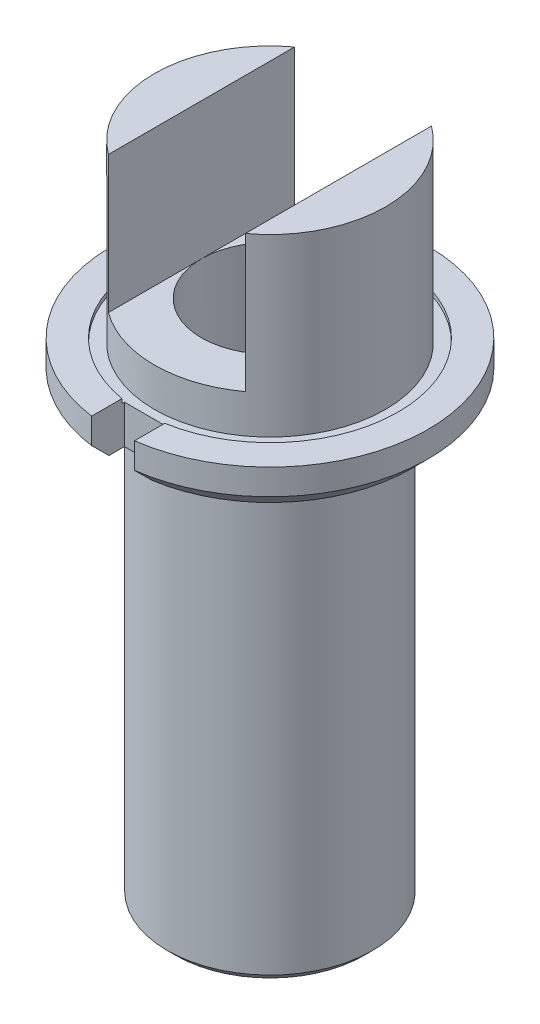
ISO-10303-21;
HEADER;
FILE_DESCRIPTION(('STEP AP214'),'2;1');
FILE_NAME('part.step','',(''),(''),'','','');
FILE_SCHEMA(('AUTOMOTIVE_DESIGN { 1 0 10303 214 1 1 1 1 }'));
ENDSEC;
DATA;
#1=APPLICATION_CONTEXT('core data for automotive mechanical design processes');
#2=APPLICATION_PROTOCOL_DEFINITION('international standard','automotive_design',2000,#1);
#3=PRODUCT_CONTEXT('',#1,'mechanical');
#4=PRODUCT('Part','Part','',(#3));
#5=PRODUCT_RELATED_PRODUCT_CATEGORY('part','',(#4));
#6=PRODUCT_DEFINITION_FORMATION('','',#4);
#7=PRODUCT_DEFINITION_CONTEXT('part definition',#1,'design');
#8=PRODUCT_DEFINITION('design','',#6,#7);
#9=PRODUCT_DEFINITION_SHAPE('','',#8);
#10=(LENGTH_UNIT() NAMED_UNIT(*) SI_UNIT(.MILLI.,.METRE.));
#11=(NAMED_UNIT(*) PLANE_ANGLE_UNIT() SI_UNIT($,.RADIAN.));
#12=(NAMED_UNIT(*) SI_UNIT($,.STERADIAN.) SOLID_ANGLE_UNIT());
#13=UNCERTAINTY_MEASURE_WITH_UNIT(LENGTH_MEASURE(1.E-05),#10,'distance_accuracy_value','');
#14=(GEOMETRIC_REPRESENTATION_CONTEXT(3) GLOBAL_UNCERTAINTY_ASSIGNED_CONTEXT((#13)) GLOBAL_UNIT_ASSIGNED_CONTEXT((#10,
#11,#12)) REPRESENTATION_CONTEXT('',''));
#15=CARTESIAN_POINT('',(0.,0.,0.));
#16=DIRECTION('',(0.,0.,1.));
#17=DIRECTION('',(1.,0.,0.));
#18=AXIS2_PLACEMENT_3D('',#15,#16,#17);
#19=CARTESIAN_POINT('',(0.,38.5,0.));
#20=DIRECTION('',(0.,1.,0.));
#21=DIRECTION('',(0.,0.,1.));
#22=AXIS2_PLACEMENT_3D('',#19,#20,#21);
#23=CYLINDRICAL_SURFACE('',#22,18.5);
#24=CARTESIAN_POINT('',(0.,18.5,0.));
#25=DIRECTION('',(0.,1.,0.));
#26=DIRECTION('',(0.,0.,1.));
#27=AXIS2_PLACEMENT_3D('',#24,#25,#26);
#28=CIRCLE('',#27,18.5);
#29=CARTESIAN_POINT('',(2.5,18.5,18.3303027798233));
#30=VERTEX_POINT('',#29);
#31=CARTESIAN_POINT('',(-2.5,18.5,18.3303027798233));
#32=VERTEX_POINT('',#31);
#33=EDGE_CURVE('E139',#30,#32,#28,.T.);
#34=ORIENTED_EDGE('',*,*,#33,.F.);
#35=DIRECTION('',(0.,1.,0.));
#36=VECTOR('',#35,1.);
#37=CARTESIAN_POINT('',(2.5,38.5,18.3303027798234));
#38=LINE('',#37,#36);
#39=CARTESIAN_POINT('',(2.5,15.5,18.3303027798234));
#40=VERTEX_POINT('',#39);
#41=EDGE_CURVE('E130',#30,#40,#38,.F.);
#42=ORIENTED_EDGE('',*,*,#41,.T.);
#43=CARTESIAN_POINT('',(0.,15.5,0.));
#44=DIRECTION('',(0.,1.,0.));
#45=DIRECTION('',(0.,0.,1.));
#46=AXIS2_PLACEMENT_3D('',#43,#44,#45);
#47=CIRCLE('',#46,18.5);
#48=CARTESIAN_POINT('',(-2.5,15.5,18.3303027798233));
#49=VERTEX_POINT('',#48);
#50=EDGE_CURVE('E204',#40,#49,#47,.T.);
#51=ORIENTED_EDGE('',*,*,#50,.T.);
#52=DIRECTION('',(0.,1.,0.));
#53=VECTOR('',#52,1.);
#54=CARTESIAN_POINT('',(-2.5,38.5,18.3303027798233));
#55=LINE('',#54,#53);
#56=EDGE_CURVE('E46',#49,#32,#55,.T.);
#57=ORIENTED_EDGE('',*,*,#56,.T.);
#58=EDGE_LOOP('',(#34,#42,#51,#57));
#59=FACE_BOUND('',#58,.T.);
#60=ADVANCED_FACE('F31',(#59),#23,.T.);
#61=CARTESIAN_POINT('',(13.5,38.5,0.));
#62=DIRECTION('',(0.,-1.,0.));
#63=DIRECTION('',(0.,0.,-1.));
#64=AXIS2_PLACEMENT_3D('',#61,#62,#63);
#65=PLANE('',#64);
#66=CARTESIAN_POINT('',(0.,38.5,0.));
#67=DIRECTION('',(0.,1.,0.));
#68=DIRECTION('',(0.,0.,1.));
#69=AXIS2_PLACEMENT_3D('',#66,#67,#68);
#70=CIRCLE('',#69,13.5);
#71=CARTESIAN_POINT('',(7.99999999999999,38.5,10.8742815854658));
#72=VERTEX_POINT('',#71);
#73=CARTESIAN_POINT('',(7.99999999999999,38.5,-10.8742815854658));
#74=VERTEX_POINT('',#73);
#75=EDGE_CURVE('E187',#72,#74,#70,.T.);
#76=ORIENTED_EDGE('',*,*,#75,.T.);
#77=DIRECTION('',(0.,0.,1.));
#78=VECTOR('',#77,1.);
#79=CARTESIAN_POINT('',(7.99999999999999,38.5,-25.));
#80=LINE('',#79,#78);
#81=EDGE_CURVE('E149',#74,#72,#80,.T.);
#82=ORIENTED_EDGE('',*,*,#81,.T.);
#83=EDGE_LOOP('',(#76,#82));
#84=FACE_BOUND('',#83,.T.);
#85=ADVANCED_FACE('F271',(#84),#65,.F.);
#86=CARTESIAN_POINT('',(0.,38.5,0.));
#87=DIRECTION('',(0.,1.,0.));
#88=DIRECTION('',(0.,0.,1.));
#89=AXIS2_PLACEMENT_3D('',#86,#87,#88);
#90=CYLINDRICAL_SURFACE('',#89,8.);
#91=CARTESIAN_POINT('',(0.,-38.5,0.));
#92=DIRECTION('',(0.,1.,0.));
#93=DIRECTION('',(0.,0.,1.));
#94=AXIS2_PLACEMENT_3D('',#91,#92,#93);
#95=CIRCLE('',#94,8.);
#96=CARTESIAN_POINT('',(0.,-38.5,8.));
#97=VERTEX_POINT('',#96);
#98=EDGE_CURVE('E191',#97,#97,#95,.T.);
#99=ORIENTED_EDGE('',*,*,#98,.F.);
#100=EDGE_LOOP('',(#99));
#101=FACE_BOUND('',#100,.T.);
#102=CARTESIAN_POINT('',(0.,-13.5,0.));
#103=DIRECTION('',(0.,1.,0.));
#104=DIRECTION('',(0.,0.,1.));
#105=AXIS2_PLACEMENT_3D('',#102,#103,#104);
#106=CIRCLE('',#105,7.99999999999999);
#107=CARTESIAN_POINT('',(0.,-13.5,7.99999999999999));
#108=VERTEX_POINT('',#107);
#109=EDGE_CURVE('E180',#108,#108,#106,.T.);
#110=ORIENTED_EDGE('',*,*,#109,.T.);
#111=EDGE_LOOP('',(#110));
#112=FACE_BOUND('',#111,.T.);
#113=ADVANCED_FACE('F291',(#101,#112),#90,.F.);
#114=CARTESIAN_POINT('',(8.00000000000001,-38.5,0.));
#115=DIRECTION('',(0.,1.,0.));
#116=DIRECTION('',(0.,0.,1.));
#117=AXIS2_PLACEMENT_3D('',#114,#115,#116);
#118=PLANE('',#117);
#119=CARTESIAN_POINT('',(0.,-38.5,0.));
#120=DIRECTION('',(0.,1.,0.));
#121=DIRECTION('',(0.,0.,1.));
#122=AXIS2_PLACEMENT_3D('',#119,#120,#121);
#123=CIRCLE('',#122,11.);
#124=CARTESIAN_POINT('',(0.,-38.5,11.));
#125=VERTEX_POINT('',#124);
#126=EDGE_CURVE('E11',#125,#125,#123,.F.);
#127=ORIENTED_EDGE('',*,*,#126,.T.);
#128=EDGE_LOOP('',(#127));
#129=FACE_BOUND('',#128,.T.);
#130=ORIENTED_EDGE('',*,*,#98,.T.);
#131=EDGE_LOOP('',(#130));
#132=FACE_BOUND('',#131,.T.);
#133=ADVANCED_FACE('F287',(#129,#132),#118,.F.);
#134=CARTESIAN_POINT('',(0.,38.5,0.));
#135=DIRECTION('',(0.,1.,0.));
#136=DIRECTION('',(0.,0.,1.));
#137=AXIS2_PLACEMENT_3D('',#134,#135,#136);
#138=CYLINDRICAL_SURFACE('',#137,12.);
#139=CARTESIAN_POINT('',(0.,-37.5,0.));
#140=DIRECTION('',(0.,1.,0.));
#141=DIRECTION('',(0.,0.,1.));
#142=AXIS2_PLACEMENT_3D('',#139,#140,#141);
#143=CIRCLE('',#142,12.);
#144=CARTESIAN_POINT('',(0.,-37.5,12.));
#145=VERTEX_POINT('',#144);
#146=EDGE_CURVE('E39',#145,#145,#143,.T.);
#147=ORIENTED_EDGE('',*,*,#146,.T.);
#148=EDGE_LOOP('',(#147));
#149=FACE_BOUND('',#148,.T.);
#150=CARTESIAN_POINT('',(0.,11.5,0.));
#151=DIRECTION('',(0.,1.,0.));
#152=DIRECTION('',(0.,0.,1.));
#153=AXIS2_PLACEMENT_3D('',#150,#151,#152);
#154=CIRCLE('',#153,12.);
#155=CARTESIAN_POINT('',(0.,11.5,12.));
#156=VERTEX_POINT('',#155);
#157=EDGE_CURVE('E201',#156,#156,#154,.F.);
#158=ORIENTED_EDGE('',*,*,#157,.T.);
#159=EDGE_LOOP('',(#158));
#160=FACE_BOUND('',#159,.T.);
#161=ADVANCED_FACE('F283',(#149,#160),#138,.T.);
#162=CARTESIAN_POINT('',(12.,13.5,0.));
#163=DIRECTION('',(0.,1.,0.));
#164=DIRECTION('',(0.,0.,1.));
#165=AXIS2_PLACEMENT_3D('',#162,#163,#164);
#166=PLANE('',#165);
#167=CARTESIAN_POINT('',(0.,13.5,0.));
#168=DIRECTION('',(0.,1.,0.));
#169=DIRECTION('',(0.,0.,1.));
#170=AXIS2_PLACEMENT_3D('',#167,#168,#169);
#171=CIRCLE('',#170,16.5);
#172=CARTESIAN_POINT('',(-2.5,13.5,16.3095064303001));
#173=VERTEX_POINT('',#172);
#174=CARTESIAN_POINT('',(2.5,13.5,16.3095064303001));
#175=VERTEX_POINT('',#174);
#176=EDGE_CURVE('E207',#173,#175,#171,.F.);
#177=ORIENTED_EDGE('',*,*,#176,.T.);
#178=DIRECTION('',(0.,0.,-1.));
#179=VECTOR('',#178,1.);
#180=CARTESIAN_POINT('',(2.5,13.5,0.));
#181=LINE('',#180,#179);
#182=CARTESIAN_POINT('',(2.5,13.5,14.5));
#183=VERTEX_POINT('',#182);
#184=EDGE_CURVE('E316',#175,#183,#181,.T.);
#185=ORIENTED_EDGE('',*,*,#184,.T.);
#186=DIRECTION('',(-1.,0.,0.));
#187=VECTOR('',#186,1.);
#188=CARTESIAN_POINT('',(12.,13.5,14.5));
#189=LINE('',#188,#187);
#190=CARTESIAN_POINT('',(-2.5,13.5,14.5));
#191=VERTEX_POINT('',#190);
#192=EDGE_CURVE('E152',#183,#191,#189,.T.);
#193=ORIENTED_EDGE('',*,*,#192,.T.);
#194=DIRECTION('',(0.,0.,1.));
#195=VECTOR('',#194,1.);
#196=CARTESIAN_POINT('',(-2.5,13.5,0.));
#197=LINE('',#196,#195);
#198=EDGE_CURVE('E317',#191,#173,#197,.T.);
#199=ORIENTED_EDGE('',*,*,#198,.T.);
#200=EDGE_LOOP('',(#177,#185,#193,#199));
#201=FACE_BOUND('',#200,.T.);
#202=CARTESIAN_POINT('',(0.,13.5,0.));
#203=DIRECTION('',(0.,1.,0.));
#204=DIRECTION('',(0.,0.,1.));
#205=AXIS2_PLACEMENT_3D('',#202,#203,#204);
#206=CIRCLE('',#205,14.);
#207=CARTESIAN_POINT('',(0.,13.5,14.));
#208=VERTEX_POINT('',#207);
#209=EDGE_CURVE('E198',#208,#208,#206,.T.);
#210=ORIENTED_EDGE('',*,*,#209,.T.);
#211=EDGE_LOOP('',(#210));
#212=FACE_BOUND('',#211,.T.);
#213=ADVANCED_FACE('F277',(#201,#212),#166,.F.);
#214=CARTESIAN_POINT('',(18.5,18.5,0.));
#215=DIRECTION('',(0.,-1.,0.));
#216=DIRECTION('',(0.,0.,-1.));
#217=AXIS2_PLACEMENT_3D('',#214,#215,#216);
#218=PLANE('',#217);
#219=CARTESIAN_POINT('',(0.,18.5,0.));
#220=DIRECTION('',(0.,1.,0.));
#221=DIRECTION('',(0.,0.,1.));
#222=AXIS2_PLACEMENT_3D('',#219,#220,#221);
#223=CIRCLE('',#222,15.);
#224=CARTESIAN_POINT('',(2.5,18.5,14.790199457749));
#225=VERTEX_POINT('',#224);
#226=CARTESIAN_POINT('',(-2.5,18.5,14.790199457749));
#227=VERTEX_POINT('',#226);
#228=EDGE_CURVE('E137',#225,#227,#223,.T.);
#229=ORIENTED_EDGE('',*,*,#228,.F.);
#230=DIRECTION('',(0.,0.,-1.));
#231=VECTOR('',#230,1.);
#232=CARTESIAN_POINT('',(2.5,18.5,14.5));
#233=LINE('',#232,#231);
#234=EDGE_CURVE('E141',#30,#225,#233,.T.);
#235=ORIENTED_EDGE('',*,*,#234,.F.);
#236=ORIENTED_EDGE('',*,*,#33,.T.);
#237=DIRECTION('',(0.,0.,1.));
#238=VECTOR('',#237,1.);
#239=CARTESIAN_POINT('',(-2.5,18.5,14.5));
#240=LINE('',#239,#238);
#241=EDGE_CURVE('E122',#227,#32,#240,.T.);
#242=ORIENTED_EDGE('',*,*,#241,.F.);
#243=EDGE_LOOP('',(#229,#235,#236,#242));
#244=FACE_BOUND('',#243,.T.);
#245=ADVANCED_FACE('F135',(#244),#218,.F.);
#246=CARTESIAN_POINT('',(0.,38.5,0.));
#247=DIRECTION('',(0.,1.,0.));
#248=DIRECTION('',(0.,0.,1.));
#249=AXIS2_PLACEMENT_3D('',#246,#247,#248);
#250=CYLINDRICAL_SURFACE('',#249,13.5);
#251=ORIENTED_EDGE('',*,*,#75,.F.);
#252=DIRECTION('',(0.,1.,0.));
#253=VECTOR('',#252,1.);
#254=CARTESIAN_POINT('',(7.99999999999999,38.5,10.8742815854658));
#255=LINE('',#254,#253);
#256=CARTESIAN_POINT('',(8.,22.5,10.8742815854658));
#257=VERTEX_POINT('',#256);
#258=EDGE_CURVE('E174',#72,#257,#255,.F.);
#259=ORIENTED_EDGE('',*,*,#258,.T.);
#260=CARTESIAN_POINT('',(0.,22.5,0.));
#261=DIRECTION('',(0.,-1.,0.));
#262=DIRECTION('',(0.,0.,-1.));
#263=AXIS2_PLACEMENT_3D('',#260,#261,#262);
#264=CIRCLE('',#263,13.5);
#265=CARTESIAN_POINT('',(-8.,22.5,10.8742815854658));
#266=VERTEX_POINT('',#265);
#267=EDGE_CURVE('E173',#257,#266,#264,.T.);
#268=ORIENTED_EDGE('',*,*,#267,.T.);
#269=DIRECTION('',(0.,1.,0.));
#270=VECTOR('',#269,1.);
#271=CARTESIAN_POINT('',(-8.00000000000001,38.5,10.8742815854658));
#272=LINE('',#271,#270);
#273=CARTESIAN_POINT('',(-8.00000000000001,38.5,10.8742815854658));
#274=VERTEX_POINT('',#273);
#275=EDGE_CURVE('E167',#266,#274,#272,.T.);
#276=ORIENTED_EDGE('',*,*,#275,.T.);
#277=CARTESIAN_POINT('',(-8.00000000000001,38.5,-10.8742815854658));
#278=VERTEX_POINT('',#277);
#279=EDGE_CURVE('E186',#278,#274,#70,.T.);
#280=ORIENTED_EDGE('',*,*,#279,.F.);
#281=DIRECTION('',(0.,1.,0.));
#282=VECTOR('',#281,1.);
#283=CARTESIAN_POINT('',(-8.00000000000001,38.5,-10.8742815854658));
#284=LINE('',#283,#282);
#285=CARTESIAN_POINT('',(-8.,22.5,-10.8742815854658));
#286=VERTEX_POINT('',#285);
#287=EDGE_CURVE('E54',#278,#286,#284,.F.);
#288=ORIENTED_EDGE('',*,*,#287,.T.);
#289=CARTESIAN_POINT('',(8.,22.5,-10.8742815854658));
#290=VERTEX_POINT('',#289);
#291=EDGE_CURVE('E170',#286,#290,#264,.T.);
#292=ORIENTED_EDGE('',*,*,#291,.T.);
#293=DIRECTION('',(0.,1.,0.));
#294=VECTOR('',#293,1.);
#295=CARTESIAN_POINT('',(7.99999999999999,38.5,-10.8742815854658));
#296=LINE('',#295,#294);
#297=EDGE_CURVE('E177',#290,#74,#296,.T.);
#298=ORIENTED_EDGE('',*,*,#297,.T.);
#299=EDGE_LOOP('',(#251,#259,#268,#276,#280,#288,#292,#298));
#300=FACE_BOUND('',#299,.T.);
#301=CARTESIAN_POINT('',(0.,18.,0.));
#302=DIRECTION('',(0.,1.,0.));
#303=DIRECTION('',(0.,0.,1.));
#304=AXIS2_PLACEMENT_3D('',#301,#302,#303);
#305=CIRCLE('',#304,13.5);
#306=CARTESIAN_POINT('',(0.,18.,13.5));
#307=VERTEX_POINT('',#306);
#308=EDGE_CURVE('E147',#307,#307,#305,.T.);
#309=ORIENTED_EDGE('',*,*,#308,.T.);
#310=EDGE_LOOP('',(#309));
#311=FACE_BOUND('',#310,.T.);
#312=ADVANCED_FACE('F269',(#300,#311),#250,.T.);
#313=ORIENTED_EDGE('',*,*,#279,.T.);
#314=DIRECTION('',(0.,0.,1.));
#315=VECTOR('',#314,1.);
#316=CARTESIAN_POINT('',(-8.00000000000001,38.5,-25.));
#317=LINE('',#316,#315);
#318=EDGE_CURVE('E163',#278,#274,#317,.T.);
#319=ORIENTED_EDGE('',*,*,#318,.F.);
#320=EDGE_LOOP('',(#313,#319));
#321=FACE_BOUND('',#320,.T.);
#322=ADVANCED_FACE('F265',(#321),#65,.F.);
#323=CARTESIAN_POINT('',(0.,38.5,0.));
#324=DIRECTION('',(0.,1.,0.));
#325=DIRECTION('',(0.,0.,1.));
#326=AXIS2_PLACEMENT_3D('',#323,#324,#325);
#327=CYLINDRICAL_SURFACE('',#326,8.);
#328=CARTESIAN_POINT('',(0.,2.5,0.));
#329=DIRECTION('',(0.,1.,0.));
#330=DIRECTION('',(0.,0.,1.));
#331=AXIS2_PLACEMENT_3D('',#328,#329,#330);
#332=CIRCLE('',#331,8.);
#333=CARTESIAN_POINT('',(0.,2.5,8.));
#334=VERTEX_POINT('',#333);
#335=EDGE_CURVE('E183',#334,#334,#332,.T.);
#336=ORIENTED_EDGE('',*,*,#335,.F.);
#337=EDGE_LOOP('',(#336));
#338=FACE_BOUND('',#337,.T.);
#339=CARTESIAN_POINT('',(0.,22.5,0.));
#340=DIRECTION('',(0.,-1.,0.));
#341=DIRECTION('',(0.,0.,-1.));
#342=AXIS2_PLACEMENT_3D('',#339,#340,#341);
#343=CIRCLE('',#342,8.);
#344=CARTESIAN_POINT('',(8.,22.5,0.));
#345=VERTEX_POINT('',#344);
#346=CARTESIAN_POINT('',(-8.,22.5,0.));
#347=VERTEX_POINT('',#346);
#348=EDGE_CURVE('E194',#345,#347,#343,.F.);
#349=ORIENTED_EDGE('',*,*,#348,.T.);
#350=EDGE_CURVE('E197',#347,#345,#343,.F.);
#351=ORIENTED_EDGE('',*,*,#350,.T.);
#352=EDGE_LOOP('',(#349,#351));
#353=FACE_BOUND('',#352,.T.);
#354=ADVANCED_FACE('F261',(#338,#353),#327,.F.);
#355=CARTESIAN_POINT('',(0.,38.5,0.));
#356=DIRECTION('',(0.,1.,0.));
#357=DIRECTION('',(0.,0.,1.));
#358=AXIS2_PLACEMENT_3D('',#355,#356,#357);
#359=CYLINDRICAL_SURFACE('',#358,8.49999999999999);
#360=CARTESIAN_POINT('',(0.,2.,0.));
#361=DIRECTION('',(0.,1.,0.));
#362=DIRECTION('',(0.,0.,1.));
#363=AXIS2_PLACEMENT_3D('',#360,#361,#362);
#364=CIRCLE('',#363,8.49999999999999);
#365=CARTESIAN_POINT('',(0.,2.,8.49999999999999));
#366=VERTEX_POINT('',#365);
#367=EDGE_CURVE('E337',#366,#366,#364,.T.);
#368=ORIENTED_EDGE('',*,*,#367,.T.);
#369=EDGE_LOOP('',(#368));
#370=FACE_BOUND('',#369,.T.);
#371=CARTESIAN_POINT('',(0.,-13.,0.));
#372=DIRECTION('',(0.,-1.,0.));
#373=DIRECTION('',(0.,0.,-1.));
#374=AXIS2_PLACEMENT_3D('',#371,#372,#373);
#375=CIRCLE('',#374,8.49999999999999);
#376=CARTESIAN_POINT('',(0.,-13.,-8.49999999999999));
#377=VERTEX_POINT('',#376);
#378=EDGE_CURVE('E335',#377,#377,#375,.T.);
#379=ORIENTED_EDGE('',*,*,#378,.T.);
#380=EDGE_LOOP('',(#379));
#381=FACE_BOUND('',#380,.T.);
#382=ADVANCED_FACE('F257',(#370,#381),#359,.F.);
#383=CARTESIAN_POINT('',(7.99999999999999,38.5,-25.));
#384=DIRECTION('',(1.,0.,0.));
#385=DIRECTION('',(0.,1.,0.));
#386=AXIS2_PLACEMENT_3D('',#383,#384,#385);
#387=PLANE('',#386);
#388=DIRECTION('',(0.,0.,1.));
#389=VECTOR('',#388,1.);
#390=CARTESIAN_POINT('',(8.,22.5,-25.));
#391=LINE('',#390,#389);
#392=EDGE_CURVE('E158',#290,#345,#391,.T.);
#393=ORIENTED_EDGE('',*,*,#392,.T.);
#394=EDGE_CURVE('E155',#345,#257,#391,.T.);
#395=ORIENTED_EDGE('',*,*,#394,.T.);
#396=ORIENTED_EDGE('',*,*,#258,.F.);
#397=ORIENTED_EDGE('',*,*,#81,.F.);
#398=ORIENTED_EDGE('',*,*,#297,.F.);
#399=EDGE_LOOP('',(#393,#395,#396,#397,#398));
#400=FACE_BOUND('',#399,.T.);
#401=ADVANCED_FACE('F251',(#400),#387,.F.);
#402=CARTESIAN_POINT('',(-8.,22.5,-25.));
#403=DIRECTION('',(0.,-1.,0.));
#404=DIRECTION('',(0.,0.,-1.));
#405=AXIS2_PLACEMENT_3D('',#402,#403,#404);
#406=PLANE('',#405);
#407=ORIENTED_EDGE('',*,*,#394,.F.);
#408=ORIENTED_EDGE('',*,*,#350,.F.);
#409=DIRECTION('',(0.,0.,1.));
#410=VECTOR('',#409,1.);
#411=CARTESIAN_POINT('',(-8.,22.5,-25.));
#412=LINE('',#411,#410);
#413=EDGE_CURVE('E160',#347,#266,#412,.T.);
#414=ORIENTED_EDGE('',*,*,#413,.T.);
#415=ORIENTED_EDGE('',*,*,#267,.F.);
#416=EDGE_LOOP('',(#407,#408,#414,#415));
#417=FACE_BOUND('',#416,.T.);
#418=ADVANCED_FACE('F247',(#417),#406,.F.);
#419=EDGE_CURVE('E159',#286,#347,#412,.T.);
#420=ORIENTED_EDGE('',*,*,#419,.T.);
#421=ORIENTED_EDGE('',*,*,#348,.F.);
#422=ORIENTED_EDGE('',*,*,#392,.F.);
#423=ORIENTED_EDGE('',*,*,#291,.F.);
#424=EDGE_LOOP('',(#420,#421,#422,#423));
#425=FACE_BOUND('',#424,.T.);
#426=ADVANCED_FACE('F250',(#425),#406,.F.);
#427=CARTESIAN_POINT('',(-8.00000000000001,38.5,-25.));
#428=DIRECTION('',(-1.,0.,0.));
#429=DIRECTION('',(0.,-1.,0.));
#430=AXIS2_PLACEMENT_3D('',#427,#428,#429);
#431=PLANE('',#430);
#432=ORIENTED_EDGE('',*,*,#413,.F.);
#433=ORIENTED_EDGE('',*,*,#419,.F.);
#434=ORIENTED_EDGE('',*,*,#287,.F.);
#435=ORIENTED_EDGE('',*,*,#318,.T.);
#436=ORIENTED_EDGE('',*,*,#275,.F.);
#437=EDGE_LOOP('',(#432,#433,#434,#435,#436));
#438=FACE_BOUND('',#437,.T.);
#439=ADVANCED_FACE('F246',(#438),#431,.F.);
#440=CARTESIAN_POINT('',(0.,18.,0.));
#441=DIRECTION('',(0.,1.,0.));
#442=DIRECTION('',(0.,0.,1.));
#443=AXIS2_PLACEMENT_3D('',#440,#441,#442);
#444=CYLINDRICAL_SURFACE('',#443,15.);
#445=CARTESIAN_POINT('',(0.,18.,0.));
#446=DIRECTION('',(0.,1.,0.));
#447=DIRECTION('',(0.,0.,1.));
#448=AXIS2_PLACEMENT_3D('',#445,#446,#447);
#449=CIRCLE('',#448,15.);
#450=CARTESIAN_POINT('',(2.5,18.,14.790199457749));
#451=VERTEX_POINT('',#450);
#452=CARTESIAN_POINT('',(-2.5,18.,14.790199457749));
#453=VERTEX_POINT('',#452);
#454=EDGE_CURVE('E146',#451,#453,#449,.T.);
#455=ORIENTED_EDGE('',*,*,#454,.F.);
#456=DIRECTION('',(0.,1.,0.));
#457=VECTOR('',#456,1.);
#458=CARTESIAN_POINT('',(2.5,18.,14.790199457749));
#459=LINE('',#458,#457);
#460=EDGE_CURVE('E145',#451,#225,#459,.T.);
#461=ORIENTED_EDGE('',*,*,#460,.T.);
#462=ORIENTED_EDGE('',*,*,#228,.T.);
#463=DIRECTION('',(0.,1.,0.));
#464=VECTOR('',#463,1.);
#465=CARTESIAN_POINT('',(-2.5,18.,14.790199457749));
#466=LINE('',#465,#464);
#467=EDGE_CURVE('E119',#227,#453,#466,.F.);
#468=ORIENTED_EDGE('',*,*,#467,.T.);
#469=EDGE_LOOP('',(#455,#461,#462,#468));
#470=FACE_BOUND('',#469,.T.);
#471=ADVANCED_FACE('F144',(#470),#444,.F.);
#472=CARTESIAN_POINT('',(0.,18.,0.));
#473=DIRECTION('',(0.,1.,0.));
#474=DIRECTION('',(0.,0.,1.));
#475=AXIS2_PLACEMENT_3D('',#472,#473,#474);
#476=PLANE('',#475);
#477=DIRECTION('',(0.,0.,-1.));
#478=VECTOR('',#477,1.);
#479=CARTESIAN_POINT('',(2.5,18.,0.));
#480=LINE('',#479,#478);
#481=CARTESIAN_POINT('',(2.5,18.,14.5));
#482=VERTEX_POINT('',#481);
#483=EDGE_CURVE('E327',#451,#482,#480,.T.);
#484=ORIENTED_EDGE('',*,*,#483,.F.);
#485=ORIENTED_EDGE('',*,*,#454,.T.);
#486=DIRECTION('',(0.,0.,1.));
#487=VECTOR('',#486,1.);
#488=CARTESIAN_POINT('',(-2.5,18.,0.));
#489=LINE('',#488,#487);
#490=CARTESIAN_POINT('',(-2.5,18.,14.5));
#491=VERTEX_POINT('',#490);
#492=EDGE_CURVE('E125',#491,#453,#489,.T.);
#493=ORIENTED_EDGE('',*,*,#492,.F.);
#494=DIRECTION('',(-1.,0.,0.));
#495=VECTOR('',#494,1.);
#496=CARTESIAN_POINT('',(0.,18.,14.5));
#497=LINE('',#496,#495);
#498=EDGE_CURVE('E312',#482,#491,#497,.T.);
#499=ORIENTED_EDGE('',*,*,#498,.F.);
#500=EDGE_LOOP('',(#484,#485,#493,#499));
#501=FACE_BOUND('',#500,.T.);
#502=ORIENTED_EDGE('',*,*,#308,.F.);
#503=EDGE_LOOP('',(#502));
#504=FACE_BOUND('',#503,.T.);
#505=ADVANCED_FACE('F239',(#501,#504),#476,.T.);
#506=CARTESIAN_POINT('',(0.,11.5,0.));
#507=DIRECTION('',(0.,1.,0.));
#508=DIRECTION('',(0.,0.,1.));
#509=AXIS2_PLACEMENT_3D('',#506,#507,#508);
#510=TOROIDAL_SURFACE('',#509,14.,2.);
#511=ORIENTED_EDGE('',*,*,#157,.F.);
#512=EDGE_LOOP('',(#511));
#513=FACE_BOUND('',#512,.T.);
#514=ORIENTED_EDGE('',*,*,#209,.F.);
#515=EDGE_LOOP('',(#514));
#516=FACE_BOUND('',#515,.T.);
#517=ADVANCED_FACE('F242',(#513,#516),#510,.F.);
#518=CARTESIAN_POINT('',(0.,15.5,0.));
#519=DIRECTION('',(0.,1.,0.));
#520=DIRECTION('',(0.,0.,1.));
#521=AXIS2_PLACEMENT_3D('',#518,#519,#520);
#522=CONICAL_SURFACE('',#521,18.5,0.785398163397449);
#523=CARTESIAN_POINT('',(2.5,7.37056185245302,10.0647182342852));
#524=CARTESIAN_POINT('',(2.5,7.62829853768218,10.3302775535014));
#525=CARTESIAN_POINT('',(2.5,7.88633032540234,10.5955500205264));
#526=CARTESIAN_POINT('',(2.5,8.40288415962502,11.125616669124));
#527=CARTESIAN_POINT('',(2.5,8.66140620557294,11.3904108512369));
#528=CARTESIAN_POINT('',(2.5,9.43755684021598,12.1842181089086));
#529=CARTESIAN_POINT('',(2.5,9.95577176703807,12.7126577901818));
#530=CARTESIAN_POINT('',(2.5,10.9932678257839,13.7684814409059));
#531=CARTESIAN_POINT('',(2.5,11.5125489502067,14.2958654177326));
#532=CARTESIAN_POINT('',(2.5,12.5518809235312,15.3498753156925));
#533=CARTESIAN_POINT('',(2.5,13.0719317732536,15.876501236016));
#534=CARTESIAN_POINT('',(2.5,14.1125992592581,16.9291857686468));
#535=CARTESIAN_POINT('',(2.5,14.6332158912447,17.4552443852015));
#536=CARTESIAN_POINT('',(2.5,15.6748836069278,18.5069314272992));
#537=CARTESIAN_POINT('',(2.5,16.1959346906976,19.0325598527697));
#538=CARTESIAN_POINT('',(2.5,17.2383778126286,20.083485481724));
#539=CARTESIAN_POINT('',(2.5,17.7597698530632,20.6087826829523));
#540=CARTESIAN_POINT('',(2.5,18.8028253343012,21.6591071281512));
#541=CARTESIAN_POINT('',(2.5,19.3244887749885,22.1841343722372));
#542=CARTESIAN_POINT('',(2.5,19.8462551154794,22.7090592672081));
#543=B_SPLINE_CURVE_WITH_KNOTS('',3,(#523,#524,#525,#526,#527,#528,#529,#530,#531,#532,#533,
#534,#535,#536,#537,#538,#539,#540,#541,#542),.UNSPECIFIED.,.F.,.F.,(4,2,2,2,2,2,2,2,2,4),(0.,
1.11020178550441,2.22040231586267,4.44079545118165,6.6611730186043,8.88155295539733,
11.1019161510449,13.3222797214295,15.5426582508393,17.7630358299952),.UNSPECIFIED.);
#544=EDGE_CURVE('E217',#175,#40,#543,.T.);
#545=ORIENTED_EDGE('',*,*,#544,.F.);
#546=ORIENTED_EDGE('',*,*,#176,.F.);
#547=CARTESIAN_POINT('',(-2.5,19.8462551154795,22.7090592672081));
#548=CARTESIAN_POINT('',(-2.5,19.3244887749885,22.1841343722372));
#549=CARTESIAN_POINT('',(-2.5,18.8028253343012,21.6591071281512));
#550=CARTESIAN_POINT('',(-2.5,17.7597698530632,20.6087826829523));
#551=CARTESIAN_POINT('',(-2.5,17.2383778126286,20.083485481724));
#552=CARTESIAN_POINT('',(-2.5,16.1959346906976,19.0325598527697));
#553=CARTESIAN_POINT('',(-2.5,15.6748836069278,18.5069314272992));
#554=CARTESIAN_POINT('',(-2.5,14.6332158912447,17.4552443852014));
#555=CARTESIAN_POINT('',(-2.5,14.1125992592581,16.9291857686468));
#556=CARTESIAN_POINT('',(-2.5,13.0719317732536,15.876501236016));
#557=CARTESIAN_POINT('',(-2.5,12.5518809235312,15.3498753156925));
#558=CARTESIAN_POINT('',(-2.5,11.5125489502067,14.2958654177326));
#559=CARTESIAN_POINT('',(-2.5,10.9932678257839,13.7684814409058));
#560=CARTESIAN_POINT('',(-2.5,9.95577176703808,12.7126577901818));
#561=CARTESIAN_POINT('',(-2.5,9.43755684021599,12.1842181089086));
#562=CARTESIAN_POINT('',(-2.5,8.66140620557295,11.3904108512369));
#563=CARTESIAN_POINT('',(-2.5,8.40288415962502,11.125616669124));
#564=CARTESIAN_POINT('',(-2.5,7.88633032540235,10.5955500205264));
#565=CARTESIAN_POINT('',(-2.5,7.62829853768219,10.3302775535014));
#566=CARTESIAN_POINT('',(-2.5,7.37056185245303,10.0647182342852));
#567=B_SPLINE_CURVE_WITH_KNOTS('',3,(#547,#548,#549,#550,#551,#552,#553,#554,#555,#556,#557,
#558,#559,#560,#561,#562,#563,#564,#565,#566),.UNSPECIFIED.,.F.,.F.,(4,2,2,2,2,2,2,2,2,4),(0.,
2.22037757915593,4.44075610856572,6.66111967895031,8.88148287459789,11.1018628113909,
13.3222403788136,15.5426335141325,16.6528340444908,17.7630358299952),.UNSPECIFIED.);
#568=EDGE_CURVE('E210',#49,#173,#567,.T.);
#569=ORIENTED_EDGE('',*,*,#568,.F.);
#570=ORIENTED_EDGE('',*,*,#50,.F.);
#571=EDGE_LOOP('',(#545,#546,#569,#570));
#572=FACE_BOUND('',#571,.T.);
#573=ADVANCED_FACE('F223',(#572),#522,.T.);
#574=CARTESIAN_POINT('',(-2.5,-38.5,14.5));
#575=DIRECTION('',(0.,0.,-1.));
#576=DIRECTION('',(-1.,0.,0.));
#577=AXIS2_PLACEMENT_3D('',#574,#575,#576);
#578=PLANE('',#577);
#579=DIRECTION('',(0.,1.,0.));
#580=VECTOR('',#579,1.);
#581=CARTESIAN_POINT('',(2.5,-38.5,14.5));
#582=LINE('',#581,#580);
#583=EDGE_CURVE('E140',#183,#482,#582,.T.);
#584=ORIENTED_EDGE('',*,*,#583,.T.);
#585=ORIENTED_EDGE('',*,*,#498,.T.);
#586=DIRECTION('',(0.,1.,0.));
#587=VECTOR('',#586,1.);
#588=CARTESIAN_POINT('',(-2.5,-38.5,14.5));
#589=LINE('',#588,#587);
#590=EDGE_CURVE('E321',#191,#491,#589,.T.);
#591=ORIENTED_EDGE('',*,*,#590,.F.);
#592=ORIENTED_EDGE('',*,*,#192,.F.);
#593=EDGE_LOOP('',(#584,#585,#591,#592));
#594=FACE_BOUND('',#593,.T.);
#595=ADVANCED_FACE('F232',(#594),#578,.F.);
#596=CARTESIAN_POINT('',(2.5,-38.5,14.5));
#597=DIRECTION('',(1.,0.,0.));
#598=DIRECTION('',(0.,0.,-1.));
#599=AXIS2_PLACEMENT_3D('',#596,#597,#598);
#600=PLANE('',#599);
#601=ORIENTED_EDGE('',*,*,#483,.T.);
#602=ORIENTED_EDGE('',*,*,#583,.F.);
#603=ORIENTED_EDGE('',*,*,#184,.F.);
#604=ORIENTED_EDGE('',*,*,#544,.T.);
#605=ORIENTED_EDGE('',*,*,#41,.F.);
#606=ORIENTED_EDGE('',*,*,#234,.T.);
#607=ORIENTED_EDGE('',*,*,#460,.F.);
#608=EDGE_LOOP('',(#601,#602,#603,#604,#605,#606,#607));
#609=FACE_BOUND('',#608,.T.);
#610=ADVANCED_FACE('F231',(#609),#600,.F.);
#611=CARTESIAN_POINT('',(-2.5,-38.5,14.5));
#612=DIRECTION('',(-1.,0.,0.));
#613=DIRECTION('',(0.,0.,1.));
#614=AXIS2_PLACEMENT_3D('',#611,#612,#613);
#615=PLANE('',#614);
#616=ORIENTED_EDGE('',*,*,#241,.T.);
#617=ORIENTED_EDGE('',*,*,#56,.F.);
#618=ORIENTED_EDGE('',*,*,#568,.T.);
#619=ORIENTED_EDGE('',*,*,#198,.F.);
#620=ORIENTED_EDGE('',*,*,#590,.T.);
#621=ORIENTED_EDGE('',*,*,#492,.T.);
#622=ORIENTED_EDGE('',*,*,#467,.F.);
#623=EDGE_LOOP('',(#616,#617,#618,#619,#620,#621,#622));
#624=FACE_BOUND('',#623,.T.);
#625=ADVANCED_FACE('F121',(#624),#615,.F.);
#626=CARTESIAN_POINT('',(0.,2.,0.));
#627=DIRECTION('',(0.,1.,0.));
#628=DIRECTION('',(0.,0.,1.));
#629=AXIS2_PLACEMENT_3D('',#626,#627,#628);
#630=TOROIDAL_SURFACE('',#629,7.99999999999999,0.5);
#631=ORIENTED_EDGE('',*,*,#335,.T.);
#632=EDGE_LOOP('',(#631));
#633=FACE_BOUND('',#632,.T.);
#634=ORIENTED_EDGE('',*,*,#367,.F.);
#635=EDGE_LOOP('',(#634));
#636=FACE_BOUND('',#635,.T.);
#637=ADVANCED_FACE('F230',(#633,#636),#630,.F.);
#638=CARTESIAN_POINT('',(0.,-13.,0.));
#639=DIRECTION('',(0.,-1.,0.));
#640=DIRECTION('',(0.,0.,-1.));
#641=AXIS2_PLACEMENT_3D('',#638,#639,#640);
#642=TOROIDAL_SURFACE('',#641,7.99999999999999,0.5);
#643=ORIENTED_EDGE('',*,*,#378,.F.);
#644=EDGE_LOOP('',(#643));
#645=FACE_BOUND('',#644,.T.);
#646=ORIENTED_EDGE('',*,*,#109,.F.);
#647=EDGE_LOOP('',(#646));
#648=FACE_BOUND('',#647,.T.);
#649=ADVANCED_FACE('F345',(#645,#648),#642,.F.);
#650=CARTESIAN_POINT('',(0.,-37.5,0.));
#651=DIRECTION('',(0.,1.,0.));
#652=DIRECTION('',(0.,0.,1.));
#653=AXIS2_PLACEMENT_3D('',#650,#651,#652);
#654=CONICAL_SURFACE('',#653,12.,0.785398163397454);
#655=ORIENTED_EDGE('',*,*,#126,.F.);
#656=EDGE_LOOP('',(#655));
#657=FACE_BOUND('',#656,.T.);
#658=ORIENTED_EDGE('',*,*,#146,.F.);
#659=EDGE_LOOP('',(#658));
#660=FACE_BOUND('',#659,.T.);
#661=ADVANCED_FACE('F33',(#657,#660),#654,.T.);
#662=CLOSED_SHELL('',(#60,#85,#113,#133,#161,#213,#245,#312,#322,#354,#382,#401,#418,#426,#439,
#471,#505,#517,#573,#595,#610,#625,#637,#649,#661));
#663=MANIFOLD_SOLID_BREP('B2',#662);
#664=ADVANCED_BREP_SHAPE_REPRESENTATION('',(#18,#663),#14);
#665=SHAPE_DEFINITION_REPRESENTATION(#9,#664);
ENDSEC;
END-ISO-10303-21;
